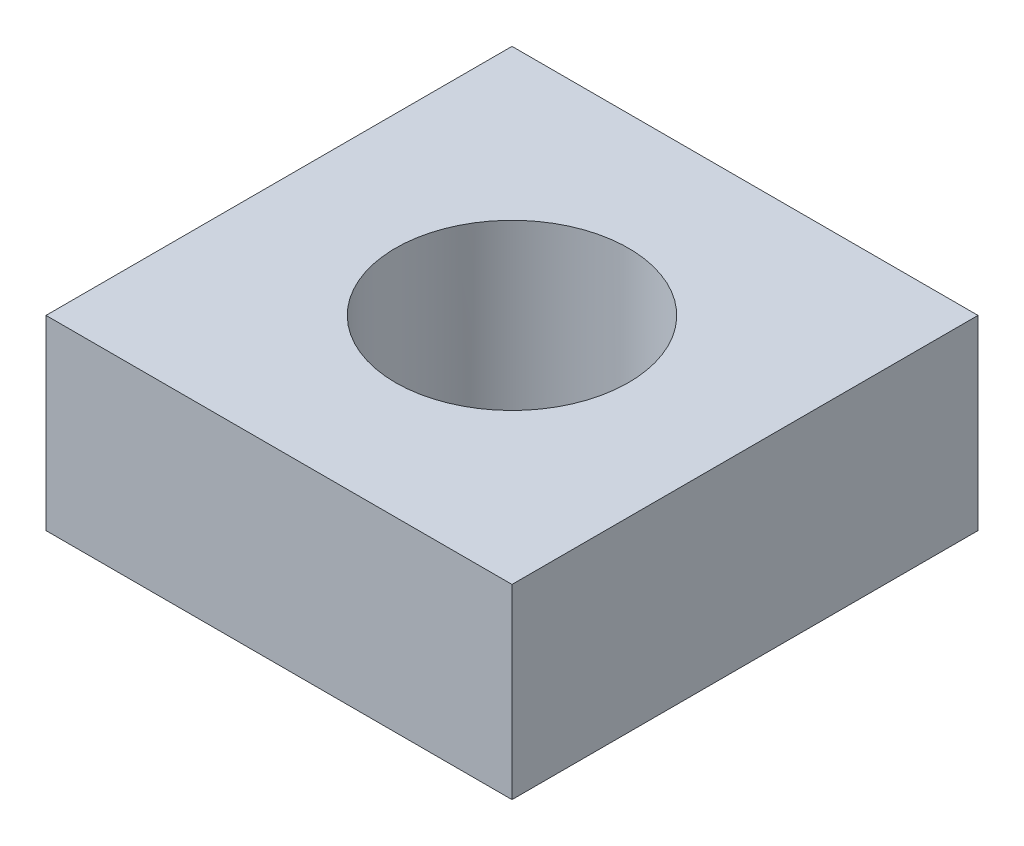
ISO-10303-21;
HEADER;
FILE_DESCRIPTION(('STEP AP214'),'2;1');
FILE_NAME('part.step','',(''),(''),'','','');
FILE_SCHEMA(('AUTOMOTIVE_DESIGN { 1 0 10303 214 1 1 1 1 }'));
ENDSEC;
DATA;
#1=APPLICATION_CONTEXT('core data for automotive mechanical design processes');
#2=APPLICATION_PROTOCOL_DEFINITION('international standard','automotive_design',2000,#1);
#3=PRODUCT_CONTEXT('',#1,'mechanical');
#4=PRODUCT('Part','Part','',(#3));
#5=PRODUCT_RELATED_PRODUCT_CATEGORY('part','',(#4));
#6=PRODUCT_DEFINITION_FORMATION('','',#4);
#7=PRODUCT_DEFINITION_CONTEXT('part definition',#1,'design');
#8=PRODUCT_DEFINITION('design','',#6,#7);
#9=PRODUCT_DEFINITION_SHAPE('','',#8);
#10=(LENGTH_UNIT() NAMED_UNIT(*) SI_UNIT(.MILLI.,.METRE.));
#11=(NAMED_UNIT(*) PLANE_ANGLE_UNIT() SI_UNIT($,.RADIAN.));
#12=(NAMED_UNIT(*) SI_UNIT($,.STERADIAN.) SOLID_ANGLE_UNIT());
#13=UNCERTAINTY_MEASURE_WITH_UNIT(LENGTH_MEASURE(1.E-05),#10,'distance_accuracy_value','');
#14=(GEOMETRIC_REPRESENTATION_CONTEXT(3) GLOBAL_UNCERTAINTY_ASSIGNED_CONTEXT((#13)) GLOBAL_UNIT_ASSIGNED_CONTEXT((#10,
#11,#12)) REPRESENTATION_CONTEXT('',''));
#15=CARTESIAN_POINT('',(0.,0.,0.));
#16=DIRECTION('',(0.,0.,1.));
#17=DIRECTION('',(1.,0.,0.));
#18=AXIS2_PLACEMENT_3D('',#15,#16,#17);
#19=CARTESIAN_POINT('',(0.,20.,0.));
#20=DIRECTION('',(1.,0.,0.));
#21=DIRECTION('',(0.,0.,-1.));
#22=AXIS2_PLACEMENT_3D('',#19,#20,#21);
#23=PLANE('',#22);
#24=DIRECTION('',(0.,0.,1.));
#25=VECTOR('',#24,1.);
#26=CARTESIAN_POINT('',(0.,0.,0.));
#27=LINE('',#26,#25);
#28=CARTESIAN_POINT('',(0.,0.,-50.));
#29=VERTEX_POINT('',#28);
#30=CARTESIAN_POINT('',(0.,0.,0.));
#31=VERTEX_POINT('',#30);
#32=EDGE_CURVE('E109',#29,#31,#27,.T.);
#33=ORIENTED_EDGE('',*,*,#32,.T.);
#34=DIRECTION('',(0.,-1.,0.));
#35=VECTOR('',#34,1.);
#36=CARTESIAN_POINT('',(0.,20.,0.));
#37=LINE('',#36,#35);
#38=CARTESIAN_POINT('',(0.,20.,0.));
#39=VERTEX_POINT('',#38);
#40=EDGE_CURVE('E11',#39,#31,#37,.T.);
#41=ORIENTED_EDGE('',*,*,#40,.F.);
#42=DIRECTION('',(0.,0.,1.));
#43=VECTOR('',#42,1.);
#44=CARTESIAN_POINT('',(0.,20.,0.));
#45=LINE('',#44,#43);
#46=CARTESIAN_POINT('',(0.,20.,-50.));
#47=VERTEX_POINT('',#46);
#48=EDGE_CURVE('E92',#47,#39,#45,.T.);
#49=ORIENTED_EDGE('',*,*,#48,.F.);
#50=DIRECTION('',(0.,-1.,0.));
#51=VECTOR('',#50,1.);
#52=CARTESIAN_POINT('',(0.,20.,-50.));
#53=LINE('',#52,#51);
#54=EDGE_CURVE('E105',#47,#29,#53,.T.);
#55=ORIENTED_EDGE('',*,*,#54,.T.);
#56=EDGE_LOOP('',(#33,#41,#49,#55));
#57=FACE_BOUND('',#56,.T.);
#58=ADVANCED_FACE('F39',(#57),#23,.F.);
#59=CARTESIAN_POINT('',(0.,20.,0.));
#60=DIRECTION('',(0.,0.,-1.));
#61=DIRECTION('',(-1.,0.,0.));
#62=AXIS2_PLACEMENT_3D('',#59,#60,#61);
#63=PLANE('',#62);
#64=DIRECTION('',(1.,0.,0.));
#65=VECTOR('',#64,1.);
#66=CARTESIAN_POINT('',(0.,0.,0.));
#67=LINE('',#66,#65);
#68=CARTESIAN_POINT('',(50.,0.,0.));
#69=VERTEX_POINT('',#68);
#70=EDGE_CURVE('E97',#31,#69,#67,.T.);
#71=ORIENTED_EDGE('',*,*,#70,.T.);
#72=DIRECTION('',(0.,-1.,0.));
#73=VECTOR('',#72,1.);
#74=CARTESIAN_POINT('',(50.,20.,0.));
#75=LINE('',#74,#73);
#76=CARTESIAN_POINT('',(50.,20.,0.));
#77=VERTEX_POINT('',#76);
#78=EDGE_CURVE('E49',#77,#69,#75,.T.);
#79=ORIENTED_EDGE('',*,*,#78,.F.);
#80=DIRECTION('',(1.,0.,0.));
#81=VECTOR('',#80,1.);
#82=CARTESIAN_POINT('',(0.,20.,0.));
#83=LINE('',#82,#81);
#84=EDGE_CURVE('E87',#39,#77,#83,.T.);
#85=ORIENTED_EDGE('',*,*,#84,.F.);
#86=ORIENTED_EDGE('',*,*,#40,.T.);
#87=EDGE_LOOP('',(#71,#79,#85,#86));
#88=FACE_BOUND('',#87,.T.);
#89=ADVANCED_FACE('F96',(#88),#63,.F.);
#90=CARTESIAN_POINT('',(50.,20.,0.));
#91=DIRECTION('',(-1.,0.,0.));
#92=DIRECTION('',(0.,0.,1.));
#93=AXIS2_PLACEMENT_3D('',#90,#91,#92);
#94=PLANE('',#93);
#95=DIRECTION('',(0.,0.,-1.));
#96=VECTOR('',#95,1.);
#97=CARTESIAN_POINT('',(50.,0.,0.));
#98=LINE('',#97,#96);
#99=CARTESIAN_POINT('',(50.,0.,-50.));
#100=VERTEX_POINT('',#99);
#101=EDGE_CURVE('E74',#69,#100,#98,.T.);
#102=ORIENTED_EDGE('',*,*,#101,.T.);
#103=DIRECTION('',(0.,-1.,0.));
#104=VECTOR('',#103,1.);
#105=CARTESIAN_POINT('',(50.,20.,-50.));
#106=LINE('',#105,#104);
#107=CARTESIAN_POINT('',(50.,20.,-50.));
#108=VERTEX_POINT('',#107);
#109=EDGE_CURVE('E99',#108,#100,#106,.T.);
#110=ORIENTED_EDGE('',*,*,#109,.F.);
#111=DIRECTION('',(0.,0.,-1.));
#112=VECTOR('',#111,1.);
#113=CARTESIAN_POINT('',(50.,20.,0.));
#114=LINE('',#113,#112);
#115=EDGE_CURVE('E90',#77,#108,#114,.T.);
#116=ORIENTED_EDGE('',*,*,#115,.F.);
#117=ORIENTED_EDGE('',*,*,#78,.T.);
#118=EDGE_LOOP('',(#102,#110,#116,#117));
#119=FACE_BOUND('',#118,.T.);
#120=ADVANCED_FACE('F101',(#119),#94,.F.);
#121=CARTESIAN_POINT('',(0.,20.,-50.));
#122=DIRECTION('',(0.,0.,1.));
#123=DIRECTION('',(1.,0.,0.));
#124=AXIS2_PLACEMENT_3D('',#121,#122,#123);
#125=PLANE('',#124);
#126=DIRECTION('',(-1.,0.,0.));
#127=VECTOR('',#126,1.);
#128=CARTESIAN_POINT('',(0.,0.,-50.));
#129=LINE('',#128,#127);
#130=EDGE_CURVE('E80',#100,#29,#129,.T.);
#131=ORIENTED_EDGE('',*,*,#130,.T.);
#132=ORIENTED_EDGE('',*,*,#54,.F.);
#133=DIRECTION('',(-1.,0.,0.));
#134=VECTOR('',#133,1.);
#135=CARTESIAN_POINT('',(0.,20.,-50.));
#136=LINE('',#135,#134);
#137=EDGE_CURVE('E57',#108,#47,#136,.T.);
#138=ORIENTED_EDGE('',*,*,#137,.F.);
#139=ORIENTED_EDGE('',*,*,#109,.T.);
#140=EDGE_LOOP('',(#131,#132,#138,#139));
#141=FACE_BOUND('',#140,.T.);
#142=ADVANCED_FACE('F122',(#141),#125,.F.);
#143=CARTESIAN_POINT('',(0.,20.,0.));
#144=DIRECTION('',(0.,-1.,0.));
#145=DIRECTION('',(0.,0.,-1.));
#146=AXIS2_PLACEMENT_3D('',#143,#144,#145);
#147=PLANE('',#146);
#148=CARTESIAN_POINT('',(25.,20.,-25.));
#149=DIRECTION('',(0.,1.,0.));
#150=DIRECTION('',(0.,0.,1.));
#151=AXIS2_PLACEMENT_3D('',#148,#149,#150);
#152=CIRCLE('',#151,12.5);
#153=CARTESIAN_POINT('',(25.,20.,-12.5));
#154=VERTEX_POINT('',#153);
#155=EDGE_CURVE('E129',#154,#154,#152,.T.);
#156=ORIENTED_EDGE('',*,*,#155,.F.);
#157=EDGE_LOOP('',(#156));
#158=FACE_BOUND('',#157,.T.);
#159=ORIENTED_EDGE('',*,*,#48,.T.);
#160=ORIENTED_EDGE('',*,*,#84,.T.);
#161=ORIENTED_EDGE('',*,*,#115,.T.);
#162=ORIENTED_EDGE('',*,*,#137,.T.);
#163=EDGE_LOOP('',(#159,#160,#161,#162));
#164=FACE_BOUND('',#163,.T.);
#165=ADVANCED_FACE('F88',(#158,#164),#147,.F.);
#166=CARTESIAN_POINT('',(0.,0.,0.));
#167=DIRECTION('',(0.,-1.,0.));
#168=DIRECTION('',(0.,0.,-1.));
#169=AXIS2_PLACEMENT_3D('',#166,#167,#168);
#170=PLANE('',#169);
#171=CARTESIAN_POINT('',(25.,0.,-25.));
#172=DIRECTION('',(0.,-1.,0.));
#173=DIRECTION('',(0.,0.,-1.));
#174=AXIS2_PLACEMENT_3D('',#171,#172,#173);
#175=CIRCLE('',#174,12.5);
#176=CARTESIAN_POINT('',(25.,0.,-37.5));
#177=VERTEX_POINT('',#176);
#178=EDGE_CURVE('E42',#177,#177,#175,.T.);
#179=ORIENTED_EDGE('',*,*,#178,.F.);
#180=EDGE_LOOP('',(#179));
#181=FACE_BOUND('',#180,.T.);
#182=ORIENTED_EDGE('',*,*,#32,.F.);
#183=ORIENTED_EDGE('',*,*,#130,.F.);
#184=ORIENTED_EDGE('',*,*,#101,.F.);
#185=ORIENTED_EDGE('',*,*,#70,.F.);
#186=EDGE_LOOP('',(#182,#183,#184,#185));
#187=FACE_BOUND('',#186,.T.);
#188=ADVANCED_FACE('F125',(#181,#187),#170,.T.);
#189=CARTESIAN_POINT('',(25.,-10.,-25.));
#190=DIRECTION('',(0.,1.,0.));
#191=DIRECTION('',(0.,0.,1.));
#192=AXIS2_PLACEMENT_3D('',#189,#190,#191);
#193=CYLINDRICAL_SURFACE('',#192,12.5);
#194=ORIENTED_EDGE('',*,*,#178,.T.);
#195=EDGE_LOOP('',(#194));
#196=FACE_BOUND('',#195,.T.);
#197=ORIENTED_EDGE('',*,*,#155,.T.);
#198=EDGE_LOOP('',(#197));
#199=FACE_BOUND('',#198,.T.);
#200=ADVANCED_FACE('F138',(#196,#199),#193,.F.);
#201=CLOSED_SHELL('',(#58,#89,#120,#142,#165,#188,#200));
#202=MANIFOLD_SOLID_BREP('B2',#201);
#203=ADVANCED_BREP_SHAPE_REPRESENTATION('',(#18,#202),#14);
#204=SHAPE_DEFINITION_REPRESENTATION(#9,#203);
ENDSEC;
END-ISO-10303-21;
